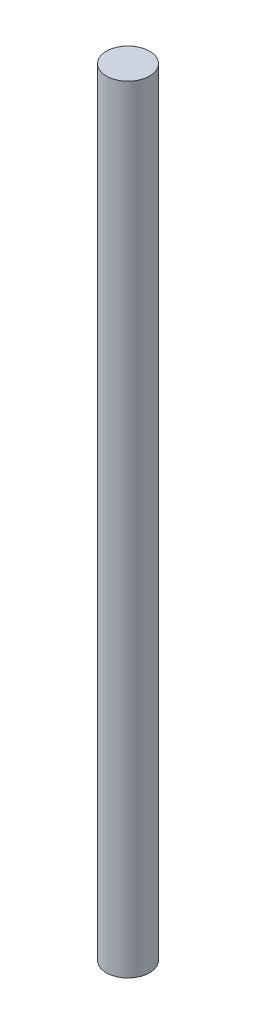
ISO-10303-21;
HEADER;
FILE_DESCRIPTION(('STEP AP214'),'2;1');
FILE_NAME('part.step','',(''),(''),'','','');
FILE_SCHEMA(('AUTOMOTIVE_DESIGN { 1 0 10303 214 1 1 1 1 }'));
ENDSEC;
DATA;
#1=APPLICATION_CONTEXT('core data for automotive mechanical design processes');
#2=APPLICATION_PROTOCOL_DEFINITION('international standard','automotive_design',2000,#1);
#3=PRODUCT_CONTEXT('',#1,'mechanical');
#4=PRODUCT('Part','Part','',(#3));
#5=PRODUCT_RELATED_PRODUCT_CATEGORY('part','',(#4));
#6=PRODUCT_DEFINITION_FORMATION('','',#4);
#7=PRODUCT_DEFINITION_CONTEXT('part definition',#1,'design');
#8=PRODUCT_DEFINITION('design','',#6,#7);
#9=PRODUCT_DEFINITION_SHAPE('','',#8);
#10=(LENGTH_UNIT() NAMED_UNIT(*) SI_UNIT(.MILLI.,.METRE.));
#11=(NAMED_UNIT(*) PLANE_ANGLE_UNIT() SI_UNIT($,.RADIAN.));
#12=(NAMED_UNIT(*) SI_UNIT($,.STERADIAN.) SOLID_ANGLE_UNIT());
#13=UNCERTAINTY_MEASURE_WITH_UNIT(LENGTH_MEASURE(1.E-05),#10,'distance_accuracy_value','');
#14=(GEOMETRIC_REPRESENTATION_CONTEXT(3) GLOBAL_UNCERTAINTY_ASSIGNED_CONTEXT((#13)) GLOBAL_UNIT_ASSIGNED_CONTEXT((#10,
#11,#12)) REPRESENTATION_CONTEXT('',''));
#15=CARTESIAN_POINT('',(0.,0.,0.));
#16=DIRECTION('',(0.,0.,1.));
#17=DIRECTION('',(1.,0.,0.));
#18=AXIS2_PLACEMENT_3D('',#15,#16,#17);
#19=CARTESIAN_POINT('',(0.,114.3,0.));
#20=DIRECTION('',(0.,-1.,0.));
#21=DIRECTION('',(0.,0.,-1.));
#22=AXIS2_PLACEMENT_3D('',#19,#20,#21);
#23=CYLINDRICAL_SURFACE('',#22,3.175);
#24=CARTESIAN_POINT('',(0.,114.3,0.));
#25=DIRECTION('',(0.,1.,0.));
#26=DIRECTION('',(0.,0.,1.));
#27=AXIS2_PLACEMENT_3D('',#24,#25,#26);
#28=CIRCLE('',#27,3.175);
#29=CARTESIAN_POINT('',(0.,114.3,3.175));
#30=VERTEX_POINT('',#29);
#31=EDGE_CURVE('E10',#30,#30,#28,.T.);
#32=ORIENTED_EDGE('',*,*,#31,.F.);
#33=EDGE_LOOP('',(#32));
#34=FACE_BOUND('',#33,.T.);
#35=CARTESIAN_POINT('',(0.,0.,0.));
#36=DIRECTION('',(0.,1.,0.));
#37=DIRECTION('',(0.,0.,1.));
#38=AXIS2_PLACEMENT_3D('',#35,#36,#37);
#39=CIRCLE('',#38,3.175);
#40=CARTESIAN_POINT('',(0.,0.,3.175));
#41=VERTEX_POINT('',#40);
#42=EDGE_CURVE('E34',#41,#41,#39,.T.);
#43=ORIENTED_EDGE('',*,*,#42,.T.);
#44=EDGE_LOOP('',(#43));
#45=FACE_BOUND('',#44,.T.);
#46=ADVANCED_FACE('F31',(#34,#45),#23,.T.);
#47=CARTESIAN_POINT('',(0.,114.3,0.));
#48=DIRECTION('',(0.,1.,0.));
#49=DIRECTION('',(0.,0.,1.));
#50=AXIS2_PLACEMENT_3D('',#47,#48,#49);
#51=PLANE('',#50);
#52=ORIENTED_EDGE('',*,*,#31,.T.);
#53=EDGE_LOOP('',(#52));
#54=FACE_BOUND('',#53,.T.);
#55=ADVANCED_FACE('F46',(#54),#51,.T.);
#56=CARTESIAN_POINT('',(0.,0.,0.));
#57=DIRECTION('',(0.,1.,0.));
#58=DIRECTION('',(0.,0.,1.));
#59=AXIS2_PLACEMENT_3D('',#56,#57,#58);
#60=PLANE('',#59);
#61=ORIENTED_EDGE('',*,*,#42,.F.);
#62=EDGE_LOOP('',(#61));
#63=FACE_BOUND('',#62,.T.);
#64=ADVANCED_FACE('F44',(#63),#60,.F.);
#65=CLOSED_SHELL('',(#46,#55,#64));
#66=MANIFOLD_SOLID_BREP('B2',#65);
#67=ADVANCED_BREP_SHAPE_REPRESENTATION('',(#18,#66),#14);
#68=SHAPE_DEFINITION_REPRESENTATION(#9,#67);
ENDSEC;
END-ISO-10303-21;
